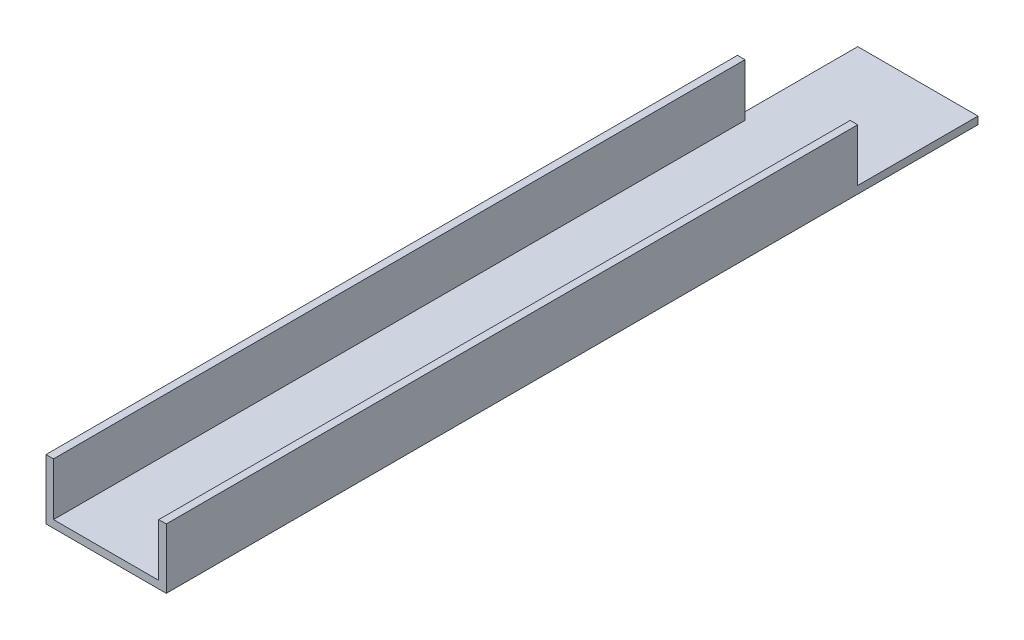
ISO-10303-21;
HEADER;
FILE_DESCRIPTION(('STEP AP214'),'2;1');
FILE_NAME('part.step','',(''),(''),'','','');
FILE_SCHEMA(('AUTOMOTIVE_DESIGN { 1 0 10303 214 1 1 1 1 }'));
ENDSEC;
DATA;
#1=APPLICATION_CONTEXT('core data for automotive mechanical design processes');
#2=APPLICATION_PROTOCOL_DEFINITION('international standard','automotive_design',2000,#1);
#3=PRODUCT_CONTEXT('',#1,'mechanical');
#4=PRODUCT('Part','Part','',(#3));
#5=PRODUCT_RELATED_PRODUCT_CATEGORY('part','',(#4));
#6=PRODUCT_DEFINITION_FORMATION('','',#4);
#7=PRODUCT_DEFINITION_CONTEXT('part definition',#1,'design');
#8=PRODUCT_DEFINITION('design','',#6,#7);
#9=PRODUCT_DEFINITION_SHAPE('','',#8);
#10=(LENGTH_UNIT() NAMED_UNIT(*) SI_UNIT(.MILLI.,.METRE.));
#11=(NAMED_UNIT(*) PLANE_ANGLE_UNIT() SI_UNIT($,.RADIAN.));
#12=(NAMED_UNIT(*) SI_UNIT($,.STERADIAN.) SOLID_ANGLE_UNIT());
#13=UNCERTAINTY_MEASURE_WITH_UNIT(LENGTH_MEASURE(1.E-05),#10,'distance_accuracy_value','');
#14=(GEOMETRIC_REPRESENTATION_CONTEXT(3) GLOBAL_UNCERTAINTY_ASSIGNED_CONTEXT((#13)) GLOBAL_UNIT_ASSIGNED_CONTEXT((#10,
#11,#12)) REPRESENTATION_CONTEXT('',''));
#15=CARTESIAN_POINT('',(0.,0.,0.));
#16=DIRECTION('',(0.,0.,1.));
#17=DIRECTION('',(1.,0.,0.));
#18=AXIS2_PLACEMENT_3D('',#15,#16,#17);
#19=CARTESIAN_POINT('',(0.,0.,342.9));
#20=DIRECTION('',(1.,0.,0.));
#21=DIRECTION('',(0.,0.,-1.));
#22=AXIS2_PLACEMENT_3D('',#19,#20,#21);
#23=PLANE('',#22);
#24=DIRECTION('',(0.,1.,0.));
#25=VECTOR('',#24,1.);
#26=CARTESIAN_POINT('',(0.,-68.6670489685532,50.8));
#27=LINE('',#26,#25);
#28=CARTESIAN_POINT('',(0.,3.175,50.8));
#29=VERTEX_POINT('',#28);
#30=CARTESIAN_POINT('',(0.,25.4,50.8));
#31=VERTEX_POINT('',#30);
#32=EDGE_CURVE('E177',#29,#31,#27,.T.);
#33=ORIENTED_EDGE('',*,*,#32,.F.);
#34=DIRECTION('',(0.,0.,1.));
#35=VECTOR('',#34,1.);
#36=CARTESIAN_POINT('',(0.,3.175,0.));
#37=LINE('',#36,#35);
#38=CARTESIAN_POINT('',(0.,3.175,0.));
#39=VERTEX_POINT('',#38);
#40=EDGE_CURVE('E174',#39,#29,#37,.T.);
#41=ORIENTED_EDGE('',*,*,#40,.F.);
#42=DIRECTION('',(0.,-1.,0.));
#43=VECTOR('',#42,1.);
#44=CARTESIAN_POINT('',(0.,0.,0.));
#45=LINE('',#44,#43);
#46=CARTESIAN_POINT('',(0.,0.,0.));
#47=VERTEX_POINT('',#46);
#48=EDGE_CURVE('E134',#39,#47,#45,.T.);
#49=ORIENTED_EDGE('',*,*,#48,.T.);
#50=DIRECTION('',(0.,0.,-1.));
#51=VECTOR('',#50,1.);
#52=CARTESIAN_POINT('',(0.,0.,342.9));
#53=LINE('',#52,#51);
#54=CARTESIAN_POINT('',(0.,0.,342.9));
#55=VERTEX_POINT('',#54);
#56=EDGE_CURVE('E11',#55,#47,#53,.T.);
#57=ORIENTED_EDGE('',*,*,#56,.F.);
#58=DIRECTION('',(0.,-1.,0.));
#59=VECTOR('',#58,1.);
#60=CARTESIAN_POINT('',(0.,0.,342.9));
#61=LINE('',#60,#59);
#62=CARTESIAN_POINT('',(0.,25.4,342.9));
#63=VERTEX_POINT('',#62);
#64=EDGE_CURVE('E143',#63,#55,#61,.T.);
#65=ORIENTED_EDGE('',*,*,#64,.F.);
#66=DIRECTION('',(0.,0.,-1.));
#67=VECTOR('',#66,1.);
#68=CARTESIAN_POINT('',(0.,25.4,342.9));
#69=LINE('',#68,#67);
#70=EDGE_CURVE('E130',#63,#31,#69,.T.);
#71=ORIENTED_EDGE('',*,*,#70,.T.);
#72=EDGE_LOOP('',(#33,#41,#49,#57,#65,#71));
#73=FACE_BOUND('',#72,.T.);
#74=ADVANCED_FACE('F38',(#73),#23,.F.);
#75=CARTESIAN_POINT('',(0.,0.,342.9));
#76=DIRECTION('',(0.,1.,0.));
#77=DIRECTION('',(0.,0.,1.));
#78=AXIS2_PLACEMENT_3D('',#75,#76,#77);
#79=PLANE('',#78);
#80=DIRECTION('',(1.,0.,0.));
#81=VECTOR('',#80,1.);
#82=CARTESIAN_POINT('',(0.,0.,0.));
#83=LINE('',#82,#81);
#84=CARTESIAN_POINT('',(50.8,0.,0.));
#85=VERTEX_POINT('',#84);
#86=EDGE_CURVE('E80',#47,#85,#83,.T.);
#87=ORIENTED_EDGE('',*,*,#86,.T.);
#88=DIRECTION('',(0.,0.,-1.));
#89=VECTOR('',#88,1.);
#90=CARTESIAN_POINT('',(50.8,0.,342.9));
#91=LINE('',#90,#89);
#92=CARTESIAN_POINT('',(50.8,0.,342.9));
#93=VERTEX_POINT('',#92);
#94=EDGE_CURVE('E46',#93,#85,#91,.T.);
#95=ORIENTED_EDGE('',*,*,#94,.F.);
#96=DIRECTION('',(1.,0.,0.));
#97=VECTOR('',#96,1.);
#98=CARTESIAN_POINT('',(0.,0.,342.9));
#99=LINE('',#98,#97);
#100=EDGE_CURVE('E86',#55,#93,#99,.T.);
#101=ORIENTED_EDGE('',*,*,#100,.F.);
#102=ORIENTED_EDGE('',*,*,#56,.T.);
#103=EDGE_LOOP('',(#87,#95,#101,#102));
#104=FACE_BOUND('',#103,.T.);
#105=ADVANCED_FACE('F169',(#104),#79,.F.);
#106=CARTESIAN_POINT('',(50.8,0.,342.9));
#107=DIRECTION('',(-1.,0.,0.));
#108=DIRECTION('',(0.,0.,1.));
#109=AXIS2_PLACEMENT_3D('',#106,#107,#108);
#110=PLANE('',#109);
#111=DIRECTION('',(0.,1.,0.));
#112=VECTOR('',#111,1.);
#113=CARTESIAN_POINT('',(50.8,0.,0.));
#114=LINE('',#113,#112);
#115=CARTESIAN_POINT('',(50.8,3.175,0.));
#116=VERTEX_POINT('',#115);
#117=EDGE_CURVE('E138',#85,#116,#114,.T.);
#118=ORIENTED_EDGE('',*,*,#117,.T.);
#119=DIRECTION('',(0.,0.,-1.));
#120=VECTOR('',#119,1.);
#121=CARTESIAN_POINT('',(50.8,3.175,0.));
#122=LINE('',#121,#120);
#123=CARTESIAN_POINT('',(50.8,3.175,50.8));
#124=VERTEX_POINT('',#123);
#125=EDGE_CURVE('E196',#124,#116,#122,.T.);
#126=ORIENTED_EDGE('',*,*,#125,.F.);
#127=DIRECTION('',(0.,1.,0.));
#128=VECTOR('',#127,1.);
#129=CARTESIAN_POINT('',(50.8,-68.6670489685532,50.8));
#130=LINE('',#129,#128);
#131=CARTESIAN_POINT('',(50.8,25.4,50.8));
#132=VERTEX_POINT('',#131);
#133=EDGE_CURVE('E194',#124,#132,#130,.T.);
#134=ORIENTED_EDGE('',*,*,#133,.T.);
#135=DIRECTION('',(0.,0.,-1.));
#136=VECTOR('',#135,1.);
#137=CARTESIAN_POINT('',(50.8,25.4,342.9));
#138=LINE('',#137,#136);
#139=CARTESIAN_POINT('',(50.8,25.4,342.9));
#140=VERTEX_POINT('',#139);
#141=EDGE_CURVE('E155',#140,#132,#138,.T.);
#142=ORIENTED_EDGE('',*,*,#141,.F.);
#143=DIRECTION('',(0.,1.,0.));
#144=VECTOR('',#143,1.);
#145=CARTESIAN_POINT('',(50.8,0.,342.9));
#146=LINE('',#145,#144);
#147=EDGE_CURVE('E165',#93,#140,#146,.T.);
#148=ORIENTED_EDGE('',*,*,#147,.F.);
#149=ORIENTED_EDGE('',*,*,#94,.T.);
#150=EDGE_LOOP('',(#118,#126,#134,#142,#148,#149));
#151=FACE_BOUND('',#150,.T.);
#152=ADVANCED_FACE('F162',(#151),#110,.F.);
#153=CARTESIAN_POINT('',(50.8,25.4,342.9));
#154=DIRECTION('',(0.,-1.,0.));
#155=DIRECTION('',(0.,0.,-1.));
#156=AXIS2_PLACEMENT_3D('',#153,#154,#155);
#157=PLANE('',#156);
#158=ORIENTED_EDGE('',*,*,#141,.T.);
#159=DIRECTION('',(1.,0.,0.));
#160=VECTOR('',#159,1.);
#161=CARTESIAN_POINT('',(50.8,25.4,50.8));
#162=LINE('',#161,#160);
#163=CARTESIAN_POINT('',(47.625,25.4,50.8));
#164=VERTEX_POINT('',#163);
#165=EDGE_CURVE('E189',#164,#132,#162,.T.);
#166=ORIENTED_EDGE('',*,*,#165,.F.);
#167=DIRECTION('',(0.,0.,-1.));
#168=VECTOR('',#167,1.);
#169=CARTESIAN_POINT('',(47.625,25.4,342.9));
#170=LINE('',#169,#168);
#171=CARTESIAN_POINT('',(47.625,25.4,342.9));
#172=VERTEX_POINT('',#171);
#173=EDGE_CURVE('E151',#172,#164,#170,.T.);
#174=ORIENTED_EDGE('',*,*,#173,.F.);
#175=DIRECTION('',(-1.,0.,0.));
#176=VECTOR('',#175,1.);
#177=CARTESIAN_POINT('',(50.8,25.4,342.9));
#178=LINE('',#177,#176);
#179=EDGE_CURVE('E206',#140,#172,#178,.T.);
#180=ORIENTED_EDGE('',*,*,#179,.F.);
#181=EDGE_LOOP('',(#158,#166,#174,#180));
#182=FACE_BOUND('',#181,.T.);
#183=ADVANCED_FACE('F211',(#182),#157,.F.);
#184=CARTESIAN_POINT('',(47.625,3.175,342.9));
#185=DIRECTION('',(1.,0.,0.));
#186=DIRECTION('',(0.,0.,-1.));
#187=AXIS2_PLACEMENT_3D('',#184,#185,#186);
#188=PLANE('',#187);
#189=ORIENTED_EDGE('',*,*,#173,.T.);
#190=DIRECTION('',(0.,-1.,0.));
#191=VECTOR('',#190,1.);
#192=CARTESIAN_POINT('',(47.625,3.175,50.8));
#193=LINE('',#192,#191);
#194=CARTESIAN_POINT('',(47.625,3.175,50.8));
#195=VERTEX_POINT('',#194);
#196=EDGE_CURVE('E136',#164,#195,#193,.T.);
#197=ORIENTED_EDGE('',*,*,#196,.T.);
#198=DIRECTION('',(0.,0.,-1.));
#199=VECTOR('',#198,1.);
#200=CARTESIAN_POINT('',(47.625,3.175,342.9));
#201=LINE('',#200,#199);
#202=CARTESIAN_POINT('',(47.625,3.175,342.9));
#203=VERTEX_POINT('',#202);
#204=EDGE_CURVE('E124',#203,#195,#201,.T.);
#205=ORIENTED_EDGE('',*,*,#204,.F.);
#206=DIRECTION('',(0.,-1.,0.));
#207=VECTOR('',#206,1.);
#208=CARTESIAN_POINT('',(47.625,3.175,342.9));
#209=LINE('',#208,#207);
#210=EDGE_CURVE('E108',#172,#203,#209,.T.);
#211=ORIENTED_EDGE('',*,*,#210,.F.);
#212=EDGE_LOOP('',(#189,#197,#205,#211));
#213=FACE_BOUND('',#212,.T.);
#214=ADVANCED_FACE('F215',(#213),#188,.F.);
#215=CARTESIAN_POINT('',(3.175,3.175,342.9));
#216=DIRECTION('',(0.,-1.,0.));
#217=DIRECTION('',(0.,0.,-1.));
#218=AXIS2_PLACEMENT_3D('',#215,#216,#217);
#219=PLANE('',#218);
#220=ORIENTED_EDGE('',*,*,#204,.T.);
#221=DIRECTION('',(1.,0.,0.));
#222=VECTOR('',#221,1.);
#223=CARTESIAN_POINT('',(50.8,3.175,50.8));
#224=LINE('',#223,#222);
#225=EDGE_CURVE('E185',#195,#124,#224,.T.);
#226=ORIENTED_EDGE('',*,*,#225,.T.);
#227=ORIENTED_EDGE('',*,*,#125,.T.);
#228=DIRECTION('',(-1.,0.,0.));
#229=VECTOR('',#228,1.);
#230=CARTESIAN_POINT('',(3.175,3.175,0.));
#231=LINE('',#230,#229);
#232=EDGE_CURVE('E55',#116,#39,#231,.T.);
#233=ORIENTED_EDGE('',*,*,#232,.T.);
#234=ORIENTED_EDGE('',*,*,#40,.T.);
#235=CARTESIAN_POINT('',(3.175,3.175,50.8));
#236=VERTEX_POINT('',#235);
#237=EDGE_CURVE('E120',#29,#236,#224,.T.);
#238=ORIENTED_EDGE('',*,*,#237,.T.);
#239=DIRECTION('',(0.,0.,-1.));
#240=VECTOR('',#239,1.);
#241=CARTESIAN_POINT('',(3.175,3.175,342.9));
#242=LINE('',#241,#240);
#243=CARTESIAN_POINT('',(3.175,3.175,342.9));
#244=VERTEX_POINT('',#243);
#245=EDGE_CURVE('E115',#244,#236,#242,.T.);
#246=ORIENTED_EDGE('',*,*,#245,.F.);
#247=DIRECTION('',(-1.,0.,0.));
#248=VECTOR('',#247,1.);
#249=CARTESIAN_POINT('',(3.175,3.175,342.9));
#250=LINE('',#249,#248);
#251=EDGE_CURVE('E101',#203,#244,#250,.T.);
#252=ORIENTED_EDGE('',*,*,#251,.F.);
#253=EDGE_LOOP('',(#220,#226,#227,#233,#234,#238,#246,#252));
#254=FACE_BOUND('',#253,.T.);
#255=ADVANCED_FACE('F116',(#254),#219,.F.);
#256=CARTESIAN_POINT('',(3.175,3.175,342.9));
#257=DIRECTION('',(-1.,0.,0.));
#258=DIRECTION('',(0.,0.,1.));
#259=AXIS2_PLACEMENT_3D('',#256,#257,#258);
#260=PLANE('',#259);
#261=ORIENTED_EDGE('',*,*,#245,.T.);
#262=DIRECTION('',(0.,1.,0.));
#263=VECTOR('',#262,1.);
#264=CARTESIAN_POINT('',(3.175,3.175,50.8));
#265=LINE('',#264,#263);
#266=CARTESIAN_POINT('',(3.175,25.4,50.8));
#267=VERTEX_POINT('',#266);
#268=EDGE_CURVE('E198',#236,#267,#265,.T.);
#269=ORIENTED_EDGE('',*,*,#268,.T.);
#270=DIRECTION('',(0.,0.,-1.));
#271=VECTOR('',#270,1.);
#272=CARTESIAN_POINT('',(3.175,25.4,342.9));
#273=LINE('',#272,#271);
#274=CARTESIAN_POINT('',(3.175,25.4,342.9));
#275=VERTEX_POINT('',#274);
#276=EDGE_CURVE('E125',#275,#267,#273,.T.);
#277=ORIENTED_EDGE('',*,*,#276,.F.);
#278=DIRECTION('',(0.,1.,0.));
#279=VECTOR('',#278,1.);
#280=CARTESIAN_POINT('',(3.175,3.175,342.9));
#281=LINE('',#280,#279);
#282=EDGE_CURVE('E105',#244,#275,#281,.T.);
#283=ORIENTED_EDGE('',*,*,#282,.F.);
#284=EDGE_LOOP('',(#261,#269,#277,#283));
#285=FACE_BOUND('',#284,.T.);
#286=ADVANCED_FACE('F127',(#285),#260,.F.);
#287=CARTESIAN_POINT('',(0.,25.4,342.9));
#288=DIRECTION('',(0.,-1.,0.));
#289=DIRECTION('',(0.,0.,-1.));
#290=AXIS2_PLACEMENT_3D('',#287,#288,#289);
#291=PLANE('',#290);
#292=ORIENTED_EDGE('',*,*,#276,.T.);
#293=EDGE_CURVE('E181',#31,#267,#162,.T.);
#294=ORIENTED_EDGE('',*,*,#293,.F.);
#295=ORIENTED_EDGE('',*,*,#70,.F.);
#296=DIRECTION('',(-1.,0.,0.));
#297=VECTOR('',#296,1.);
#298=CARTESIAN_POINT('',(0.,25.4,342.9));
#299=LINE('',#298,#297);
#300=EDGE_CURVE('E64',#275,#63,#299,.T.);
#301=ORIENTED_EDGE('',*,*,#300,.F.);
#302=EDGE_LOOP('',(#292,#294,#295,#301));
#303=FACE_BOUND('',#302,.T.);
#304=ADVANCED_FACE('F260',(#303),#291,.F.);
#305=CARTESIAN_POINT('',(0.,0.,342.9));
#306=DIRECTION('',(0.,0.,-1.));
#307=DIRECTION('',(-1.,0.,0.));
#308=AXIS2_PLACEMENT_3D('',#305,#306,#307);
#309=PLANE('',#308);
#310=ORIENTED_EDGE('',*,*,#64,.T.);
#311=ORIENTED_EDGE('',*,*,#100,.T.);
#312=ORIENTED_EDGE('',*,*,#147,.T.);
#313=ORIENTED_EDGE('',*,*,#179,.T.);
#314=ORIENTED_EDGE('',*,*,#210,.T.);
#315=ORIENTED_EDGE('',*,*,#251,.T.);
#316=ORIENTED_EDGE('',*,*,#282,.T.);
#317=ORIENTED_EDGE('',*,*,#300,.T.);
#318=EDGE_LOOP('',(#310,#311,#312,#313,#314,#315,#316,#317));
#319=FACE_BOUND('',#318,.T.);
#320=ADVANCED_FACE('F103',(#319),#309,.F.);
#321=CARTESIAN_POINT('',(0.,0.,0.));
#322=DIRECTION('',(0.,0.,-1.));
#323=DIRECTION('',(-1.,0.,0.));
#324=AXIS2_PLACEMENT_3D('',#321,#322,#323);
#325=PLANE('',#324);
#326=ORIENTED_EDGE('',*,*,#232,.F.);
#327=ORIENTED_EDGE('',*,*,#117,.F.);
#328=ORIENTED_EDGE('',*,*,#86,.F.);
#329=ORIENTED_EDGE('',*,*,#48,.F.);
#330=EDGE_LOOP('',(#326,#327,#328,#329));
#331=FACE_BOUND('',#330,.T.);
#332=ADVANCED_FACE('F166',(#331),#325,.T.);
#333=CARTESIAN_POINT('',(50.8,-68.6670489685532,50.8));
#334=DIRECTION('',(0.,0.,1.));
#335=DIRECTION('',(1.,0.,0.));
#336=AXIS2_PLACEMENT_3D('',#333,#334,#335);
#337=PLANE('',#336);
#338=ORIENTED_EDGE('',*,*,#237,.F.);
#339=ORIENTED_EDGE('',*,*,#32,.T.);
#340=ORIENTED_EDGE('',*,*,#293,.T.);
#341=ORIENTED_EDGE('',*,*,#268,.F.);
#342=EDGE_LOOP('',(#338,#339,#340,#341));
#343=FACE_BOUND('',#342,.T.);
#344=ADVANCED_FACE('F237',(#343),#337,.F.);
#345=ORIENTED_EDGE('',*,*,#165,.T.);
#346=ORIENTED_EDGE('',*,*,#133,.F.);
#347=ORIENTED_EDGE('',*,*,#225,.F.);
#348=ORIENTED_EDGE('',*,*,#196,.F.);
#349=EDGE_LOOP('',(#345,#346,#347,#348));
#350=FACE_BOUND('',#349,.T.);
#351=ADVANCED_FACE('F235',(#350),#337,.F.);
#352=CLOSED_SHELL('',(#74,#105,#152,#183,#214,#255,#286,#304,#320,#332,#344,#351));
#353=MANIFOLD_SOLID_BREP('B2',#352);
#354=ADVANCED_BREP_SHAPE_REPRESENTATION('',(#18,#353),#14);
#355=SHAPE_DEFINITION_REPRESENTATION(#9,#354);
ENDSEC;
END-ISO-10303-21;
